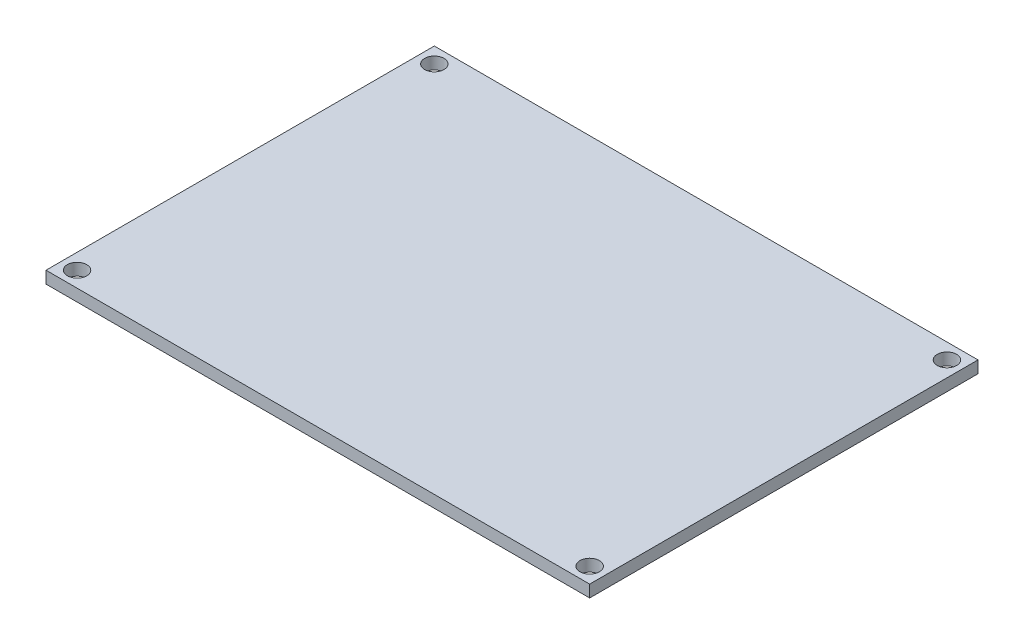
ISO-10303-21;
HEADER;
FILE_DESCRIPTION(('STEP AP214'),'2;1');
FILE_NAME('part.step','',(''),(''),'','','');
FILE_SCHEMA(('AUTOMOTIVE_DESIGN { 1 0 10303 214 1 1 1 1 }'));
ENDSEC;
DATA;
#1=APPLICATION_CONTEXT('core data for automotive mechanical design processes');
#2=APPLICATION_PROTOCOL_DEFINITION('international standard','automotive_design',2000,#1);
#3=PRODUCT_CONTEXT('',#1,'mechanical');
#4=PRODUCT('Part','Part','',(#3));
#5=PRODUCT_RELATED_PRODUCT_CATEGORY('part','',(#4));
#6=PRODUCT_DEFINITION_FORMATION('','',#4);
#7=PRODUCT_DEFINITION_CONTEXT('part definition',#1,'design');
#8=PRODUCT_DEFINITION('design','',#6,#7);
#9=PRODUCT_DEFINITION_SHAPE('','',#8);
#10=(LENGTH_UNIT() NAMED_UNIT(*) SI_UNIT(.MILLI.,.METRE.));
#11=(NAMED_UNIT(*) PLANE_ANGLE_UNIT() SI_UNIT($,.RADIAN.));
#12=(NAMED_UNIT(*) SI_UNIT($,.STERADIAN.) SOLID_ANGLE_UNIT());
#13=UNCERTAINTY_MEASURE_WITH_UNIT(LENGTH_MEASURE(1.E-05),#10,'distance_accuracy_value','');
#14=(GEOMETRIC_REPRESENTATION_CONTEXT(3) GLOBAL_UNCERTAINTY_ASSIGNED_CONTEXT((#13)) GLOBAL_UNIT_ASSIGNED_CONTEXT((#10,
#11,#12)) REPRESENTATION_CONTEXT('',''));
#15=CARTESIAN_POINT('',(0.,0.,0.));
#16=DIRECTION('',(0.,0.,1.));
#17=DIRECTION('',(1.,0.,0.));
#18=AXIS2_PLACEMENT_3D('',#15,#16,#17);
#19=CARTESIAN_POINT('',(0.,1.55,0.));
#20=DIRECTION('',(1.,0.,0.));
#21=DIRECTION('',(0.,0.,-1.));
#22=AXIS2_PLACEMENT_3D('',#19,#20,#21);
#23=PLANE('',#22);
#24=DIRECTION('',(0.,0.,1.));
#25=VECTOR('',#24,1.);
#26=CARTESIAN_POINT('',(0.,0.,0.));
#27=LINE('',#26,#25);
#28=CARTESIAN_POINT('',(0.,0.,-50.));
#29=VERTEX_POINT('',#28);
#30=CARTESIAN_POINT('',(0.,0.,0.));
#31=VERTEX_POINT('',#30);
#32=EDGE_CURVE('E111',#29,#31,#27,.T.);
#33=ORIENTED_EDGE('',*,*,#32,.T.);
#34=DIRECTION('',(0.,-1.,0.));
#35=VECTOR('',#34,1.);
#36=CARTESIAN_POINT('',(0.,1.55,0.));
#37=LINE('',#36,#35);
#38=CARTESIAN_POINT('',(0.,1.55,0.));
#39=VERTEX_POINT('',#38);
#40=EDGE_CURVE('E11',#39,#31,#37,.T.);
#41=ORIENTED_EDGE('',*,*,#40,.F.);
#42=DIRECTION('',(0.,0.,1.));
#43=VECTOR('',#42,1.);
#44=CARTESIAN_POINT('',(0.,1.55,0.));
#45=LINE('',#44,#43);
#46=CARTESIAN_POINT('',(0.,1.55,-50.));
#47=VERTEX_POINT('',#46);
#48=EDGE_CURVE('E95',#47,#39,#45,.T.);
#49=ORIENTED_EDGE('',*,*,#48,.F.);
#50=DIRECTION('',(0.,-1.,0.));
#51=VECTOR('',#50,1.);
#52=CARTESIAN_POINT('',(0.,1.55,-50.));
#53=LINE('',#52,#51);
#54=EDGE_CURVE('E107',#47,#29,#53,.T.);
#55=ORIENTED_EDGE('',*,*,#54,.T.);
#56=EDGE_LOOP('',(#33,#41,#49,#55));
#57=FACE_BOUND('',#56,.T.);
#58=ADVANCED_FACE('F43',(#57),#23,.F.);
#59=CARTESIAN_POINT('',(0.,1.55,0.));
#60=DIRECTION('',(0.,0.,-1.));
#61=DIRECTION('',(-1.,0.,0.));
#62=AXIS2_PLACEMENT_3D('',#59,#60,#61);
#63=PLANE('',#62);
#64=DIRECTION('',(1.,0.,0.));
#65=VECTOR('',#64,1.);
#66=CARTESIAN_POINT('',(0.,0.,0.));
#67=LINE('',#66,#65);
#68=CARTESIAN_POINT('',(70.,0.,0.));
#69=VERTEX_POINT('',#68);
#70=EDGE_CURVE('E100',#31,#69,#67,.T.);
#71=ORIENTED_EDGE('',*,*,#70,.T.);
#72=DIRECTION('',(0.,-1.,0.));
#73=VECTOR('',#72,1.);
#74=CARTESIAN_POINT('',(70.,1.55,0.));
#75=LINE('',#74,#73);
#76=CARTESIAN_POINT('',(70.,1.55,0.));
#77=VERTEX_POINT('',#76);
#78=EDGE_CURVE('E52',#77,#69,#75,.T.);
#79=ORIENTED_EDGE('',*,*,#78,.F.);
#80=DIRECTION('',(1.,0.,0.));
#81=VECTOR('',#80,1.);
#82=CARTESIAN_POINT('',(0.,1.55,0.));
#83=LINE('',#82,#81);
#84=EDGE_CURVE('E90',#39,#77,#83,.T.);
#85=ORIENTED_EDGE('',*,*,#84,.F.);
#86=ORIENTED_EDGE('',*,*,#40,.T.);
#87=EDGE_LOOP('',(#71,#79,#85,#86));
#88=FACE_BOUND('',#87,.T.);
#89=ADVANCED_FACE('F99',(#88),#63,.F.);
#90=CARTESIAN_POINT('',(70.,1.55,0.));
#91=DIRECTION('',(-1.,0.,0.));
#92=DIRECTION('',(0.,0.,1.));
#93=AXIS2_PLACEMENT_3D('',#90,#91,#92);
#94=PLANE('',#93);
#95=DIRECTION('',(0.,0.,-1.));
#96=VECTOR('',#95,1.);
#97=CARTESIAN_POINT('',(70.,0.,0.));
#98=LINE('',#97,#96);
#99=CARTESIAN_POINT('',(70.,0.,-50.));
#100=VERTEX_POINT('',#99);
#101=EDGE_CURVE('E77',#69,#100,#98,.T.);
#102=ORIENTED_EDGE('',*,*,#101,.T.);
#103=DIRECTION('',(0.,-1.,0.));
#104=VECTOR('',#103,1.);
#105=CARTESIAN_POINT('',(70.,1.55,-50.));
#106=LINE('',#105,#104);
#107=CARTESIAN_POINT('',(70.,1.55,-50.));
#108=VERTEX_POINT('',#107);
#109=EDGE_CURVE('E102',#108,#100,#106,.T.);
#110=ORIENTED_EDGE('',*,*,#109,.F.);
#111=DIRECTION('',(0.,0.,-1.));
#112=VECTOR('',#111,1.);
#113=CARTESIAN_POINT('',(70.,1.55,0.));
#114=LINE('',#113,#112);
#115=EDGE_CURVE('E93',#77,#108,#114,.T.);
#116=ORIENTED_EDGE('',*,*,#115,.F.);
#117=ORIENTED_EDGE('',*,*,#78,.T.);
#118=EDGE_LOOP('',(#102,#110,#116,#117));
#119=FACE_BOUND('',#118,.T.);
#120=ADVANCED_FACE('F103',(#119),#94,.F.);
#121=CARTESIAN_POINT('',(0.,1.55,-50.));
#122=DIRECTION('',(0.,0.,1.));
#123=DIRECTION('',(1.,0.,0.));
#124=AXIS2_PLACEMENT_3D('',#121,#122,#123);
#125=PLANE('',#124);
#126=DIRECTION('',(-1.,0.,0.));
#127=VECTOR('',#126,1.);
#128=CARTESIAN_POINT('',(0.,0.,-50.));
#129=LINE('',#128,#127);
#130=EDGE_CURVE('E83',#100,#29,#129,.T.);
#131=ORIENTED_EDGE('',*,*,#130,.T.);
#132=ORIENTED_EDGE('',*,*,#54,.F.);
#133=DIRECTION('',(-1.,0.,0.));
#134=VECTOR('',#133,1.);
#135=CARTESIAN_POINT('',(0.,1.55,-50.));
#136=LINE('',#135,#134);
#137=EDGE_CURVE('E60',#108,#47,#136,.T.);
#138=ORIENTED_EDGE('',*,*,#137,.F.);
#139=ORIENTED_EDGE('',*,*,#109,.T.);
#140=EDGE_LOOP('',(#131,#132,#138,#139));
#141=FACE_BOUND('',#140,.T.);
#142=ADVANCED_FACE('F125',(#141),#125,.F.);
#143=CARTESIAN_POINT('',(0.,1.55,0.));
#144=DIRECTION('',(0.,-1.,0.));
#145=DIRECTION('',(0.,0.,-1.));
#146=AXIS2_PLACEMENT_3D('',#143,#144,#145);
#147=PLANE('',#146);
#148=CARTESIAN_POINT('',(2.00000000000001,1.55,-2.));
#149=DIRECTION('',(0.,1.,0.));
#150=DIRECTION('',(0.,0.,1.));
#151=AXIS2_PLACEMENT_3D('',#148,#149,#150);
#152=CIRCLE('',#151,1.25);
#153=CARTESIAN_POINT('',(2.00000000000001,1.55,-0.75));
#154=VERTEX_POINT('',#153);
#155=EDGE_CURVE('E144',#154,#154,#152,.T.);
#156=ORIENTED_EDGE('',*,*,#155,.F.);
#157=EDGE_LOOP('',(#156));
#158=FACE_BOUND('',#157,.T.);
#159=CARTESIAN_POINT('',(68.,1.55,-2.));
#160=DIRECTION('',(0.,1.,0.));
#161=DIRECTION('',(0.,0.,1.));
#162=AXIS2_PLACEMENT_3D('',#159,#160,#161);
#163=CIRCLE('',#162,1.25);
#164=CARTESIAN_POINT('',(68.,1.55,-0.750000000000002));
#165=VERTEX_POINT('',#164);
#166=EDGE_CURVE('E152',#165,#165,#163,.T.);
#167=ORIENTED_EDGE('',*,*,#166,.F.);
#168=EDGE_LOOP('',(#167));
#169=FACE_BOUND('',#168,.T.);
#170=CARTESIAN_POINT('',(68.,1.55,-48.));
#171=DIRECTION('',(0.,1.,0.));
#172=DIRECTION('',(0.,0.,1.));
#173=AXIS2_PLACEMENT_3D('',#170,#171,#172);
#174=CIRCLE('',#173,1.25);
#175=CARTESIAN_POINT('',(68.,1.55,-46.75));
#176=VERTEX_POINT('',#175);
#177=EDGE_CURVE('E136',#176,#176,#174,.T.);
#178=ORIENTED_EDGE('',*,*,#177,.F.);
#179=EDGE_LOOP('',(#178));
#180=FACE_BOUND('',#179,.T.);
#181=CARTESIAN_POINT('',(2.,1.55,-48.));
#182=DIRECTION('',(0.,1.,0.));
#183=DIRECTION('',(0.,0.,1.));
#184=AXIS2_PLACEMENT_3D('',#181,#182,#183);
#185=CIRCLE('',#184,1.25);
#186=CARTESIAN_POINT('',(2.,1.55,-46.75));
#187=VERTEX_POINT('',#186);
#188=EDGE_CURVE('E132',#187,#187,#185,.T.);
#189=ORIENTED_EDGE('',*,*,#188,.F.);
#190=EDGE_LOOP('',(#189));
#191=FACE_BOUND('',#190,.T.);
#192=ORIENTED_EDGE('',*,*,#48,.T.);
#193=ORIENTED_EDGE('',*,*,#84,.T.);
#194=ORIENTED_EDGE('',*,*,#115,.T.);
#195=ORIENTED_EDGE('',*,*,#137,.T.);
#196=EDGE_LOOP('',(#192,#193,#194,#195));
#197=FACE_BOUND('',#196,.T.);
#198=ADVANCED_FACE('F91',(#158,#169,#180,#191,#197),#147,.F.);
#199=CARTESIAN_POINT('',(0.,0.,0.));
#200=DIRECTION('',(0.,-1.,0.));
#201=DIRECTION('',(0.,0.,-1.));
#202=AXIS2_PLACEMENT_3D('',#199,#200,#201);
#203=PLANE('',#202);
#204=CARTESIAN_POINT('',(2.00000000000001,0.,-2.));
#205=DIRECTION('',(0.,1.,0.));
#206=DIRECTION('',(0.,0.,1.));
#207=AXIS2_PLACEMENT_3D('',#204,#205,#206);
#208=CIRCLE('',#207,1.25);
#209=CARTESIAN_POINT('',(2.00000000000001,0.,-0.75));
#210=VERTEX_POINT('',#209);
#211=EDGE_CURVE('E140',#210,#210,#208,.T.);
#212=ORIENTED_EDGE('',*,*,#211,.T.);
#213=EDGE_LOOP('',(#212));
#214=FACE_BOUND('',#213,.T.);
#215=CARTESIAN_POINT('',(68.,0.,-2.));
#216=DIRECTION('',(0.,1.,0.));
#217=DIRECTION('',(0.,0.,1.));
#218=AXIS2_PLACEMENT_3D('',#215,#216,#217);
#219=CIRCLE('',#218,1.25);
#220=CARTESIAN_POINT('',(68.,0.,-0.750000000000002));
#221=VERTEX_POINT('',#220);
#222=EDGE_CURVE('E148',#221,#221,#219,.T.);
#223=ORIENTED_EDGE('',*,*,#222,.T.);
#224=EDGE_LOOP('',(#223));
#225=FACE_BOUND('',#224,.T.);
#226=CARTESIAN_POINT('',(68.,0.,-48.));
#227=DIRECTION('',(0.,1.,0.));
#228=DIRECTION('',(0.,0.,1.));
#229=AXIS2_PLACEMENT_3D('',#226,#227,#228);
#230=CIRCLE('',#229,1.25);
#231=CARTESIAN_POINT('',(68.,0.,-46.75));
#232=VERTEX_POINT('',#231);
#233=EDGE_CURVE('E156',#232,#232,#230,.T.);
#234=ORIENTED_EDGE('',*,*,#233,.T.);
#235=EDGE_LOOP('',(#234));
#236=FACE_BOUND('',#235,.T.);
#237=CARTESIAN_POINT('',(2.,0.,-48.));
#238=DIRECTION('',(0.,1.,0.));
#239=DIRECTION('',(0.,0.,1.));
#240=AXIS2_PLACEMENT_3D('',#237,#238,#239);
#241=CIRCLE('',#240,1.25);
#242=CARTESIAN_POINT('',(2.,0.,-46.75));
#243=VERTEX_POINT('',#242);
#244=EDGE_CURVE('E115',#243,#243,#241,.T.);
#245=ORIENTED_EDGE('',*,*,#244,.T.);
#246=EDGE_LOOP('',(#245));
#247=FACE_BOUND('',#246,.T.);
#248=ORIENTED_EDGE('',*,*,#32,.F.);
#249=ORIENTED_EDGE('',*,*,#130,.F.);
#250=ORIENTED_EDGE('',*,*,#101,.F.);
#251=ORIENTED_EDGE('',*,*,#70,.F.);
#252=EDGE_LOOP('',(#248,#249,#250,#251));
#253=FACE_BOUND('',#252,.T.);
#254=ADVANCED_FACE('F128',(#214,#225,#236,#247,#253),#203,.T.);
#255=CARTESIAN_POINT('',(2.,0.,-48.));
#256=DIRECTION('',(0.,1.,0.));
#257=DIRECTION('',(0.,0.,1.));
#258=AXIS2_PLACEMENT_3D('',#255,#256,#257);
#259=CYLINDRICAL_SURFACE('',#258,1.25);
#260=ORIENTED_EDGE('',*,*,#244,.F.);
#261=EDGE_LOOP('',(#260));
#262=FACE_BOUND('',#261,.T.);
#263=ORIENTED_EDGE('',*,*,#188,.T.);
#264=EDGE_LOOP('',(#263));
#265=FACE_BOUND('',#264,.T.);
#266=ADVANCED_FACE('F172',(#262,#265),#259,.F.);
#267=CARTESIAN_POINT('',(68.,0.,-48.));
#268=DIRECTION('',(0.,1.,0.));
#269=DIRECTION('',(0.,0.,1.));
#270=AXIS2_PLACEMENT_3D('',#267,#268,#269);
#271=CYLINDRICAL_SURFACE('',#270,1.25);
#272=ORIENTED_EDGE('',*,*,#233,.F.);
#273=EDGE_LOOP('',(#272));
#274=FACE_BOUND('',#273,.T.);
#275=ORIENTED_EDGE('',*,*,#177,.T.);
#276=EDGE_LOOP('',(#275));
#277=FACE_BOUND('',#276,.T.);
#278=ADVANCED_FACE('F164',(#274,#277),#271,.F.);
#279=CARTESIAN_POINT('',(68.,0.,-2.));
#280=DIRECTION('',(0.,1.,0.));
#281=DIRECTION('',(0.,0.,1.));
#282=AXIS2_PLACEMENT_3D('',#279,#280,#281);
#283=CYLINDRICAL_SURFACE('',#282,1.25);
#284=ORIENTED_EDGE('',*,*,#222,.F.);
#285=EDGE_LOOP('',(#284));
#286=FACE_BOUND('',#285,.T.);
#287=ORIENTED_EDGE('',*,*,#166,.T.);
#288=EDGE_LOOP('',(#287));
#289=FACE_BOUND('',#288,.T.);
#290=ADVANCED_FACE('F180',(#286,#289),#283,.F.);
#291=CARTESIAN_POINT('',(2.00000000000001,0.,-2.));
#292=DIRECTION('',(0.,1.,0.));
#293=DIRECTION('',(0.,0.,1.));
#294=AXIS2_PLACEMENT_3D('',#291,#292,#293);
#295=CYLINDRICAL_SURFACE('',#294,1.25);
#296=ORIENTED_EDGE('',*,*,#211,.F.);
#297=EDGE_LOOP('',(#296));
#298=FACE_BOUND('',#297,.T.);
#299=ORIENTED_EDGE('',*,*,#155,.T.);
#300=EDGE_LOOP('',(#299));
#301=FACE_BOUND('',#300,.T.);
#302=ADVANCED_FACE('F231',(#298,#301),#295,.F.);
#303=CLOSED_SHELL('',(#58,#89,#120,#142,#198,#254,#266,#278,#290,#302));
#304=MANIFOLD_SOLID_BREP('B2',#303);
#305=ADVANCED_BREP_SHAPE_REPRESENTATION('',(#18,#304),#14);
#306=SHAPE_DEFINITION_REPRESENTATION(#9,#305);
ENDSEC;
END-ISO-10303-21;
